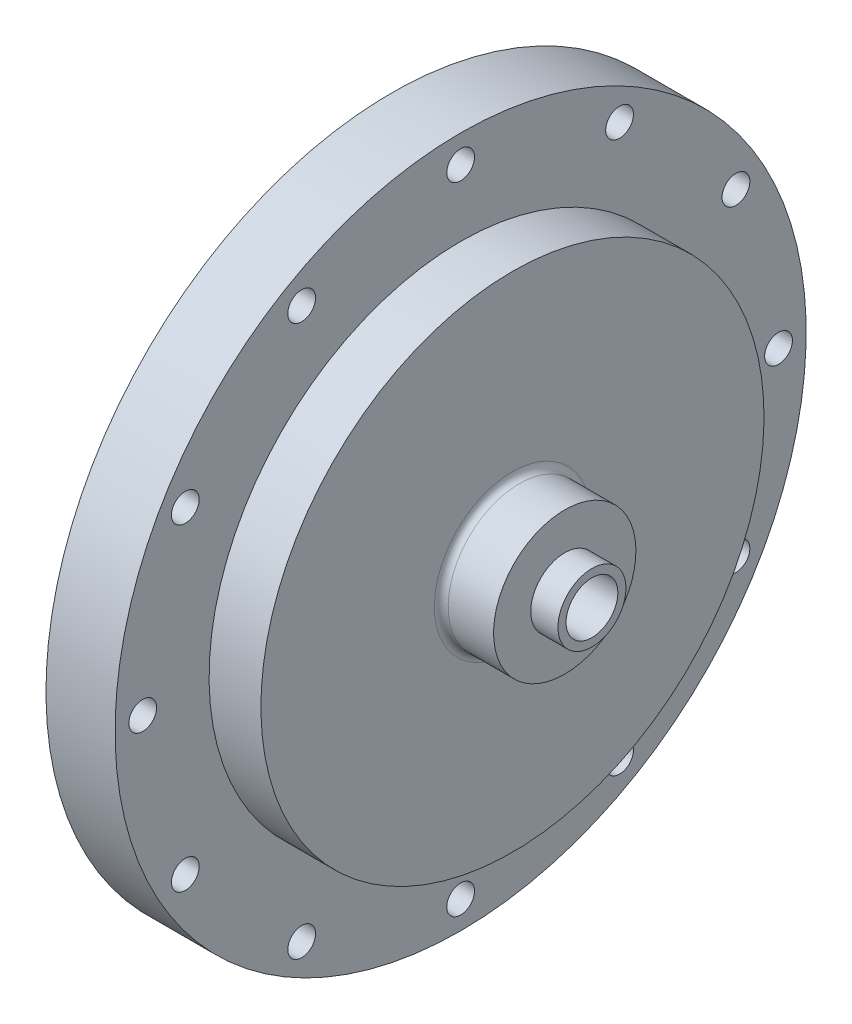
ISO-10303-21;
HEADER;
FILE_DESCRIPTION(('STEP AP214'),'2;1');
FILE_NAME('part.step','',(''),(''),'','','');
FILE_SCHEMA(('AUTOMOTIVE_DESIGN { 1 0 10303 214 1 1 1 1 }'));
ENDSEC;
DATA;
#1=APPLICATION_CONTEXT('core data for automotive mechanical design processes');
#2=APPLICATION_PROTOCOL_DEFINITION('international standard','automotive_design',2000,#1);
#3=PRODUCT_CONTEXT('',#1,'mechanical');
#4=PRODUCT('Part','Part','',(#3));
#5=PRODUCT_RELATED_PRODUCT_CATEGORY('part','',(#4));
#6=PRODUCT_DEFINITION_FORMATION('','',#4);
#7=PRODUCT_DEFINITION_CONTEXT('part definition',#1,'design');
#8=PRODUCT_DEFINITION('design','',#6,#7);
#9=PRODUCT_DEFINITION_SHAPE('','',#8);
#10=(LENGTH_UNIT() NAMED_UNIT(*) SI_UNIT(.MILLI.,.METRE.));
#11=(NAMED_UNIT(*) PLANE_ANGLE_UNIT() SI_UNIT($,.RADIAN.));
#12=(NAMED_UNIT(*) SI_UNIT($,.STERADIAN.) SOLID_ANGLE_UNIT());
#13=UNCERTAINTY_MEASURE_WITH_UNIT(LENGTH_MEASURE(1.E-05),#10,'distance_accuracy_value','');
#14=(GEOMETRIC_REPRESENTATION_CONTEXT(3) GLOBAL_UNCERTAINTY_ASSIGNED_CONTEXT((#13)) GLOBAL_UNIT_ASSIGNED_CONTEXT((#10,
#11,#12)) REPRESENTATION_CONTEXT('',''));
#15=CARTESIAN_POINT('',(0.,0.,0.));
#16=DIRECTION('',(0.,0.,1.));
#17=DIRECTION('',(1.,0.,0.));
#18=AXIS2_PLACEMENT_3D('',#15,#16,#17);
#19=CARTESIAN_POINT('',(31.75,63.5,0.));
#20=DIRECTION('',(-1.,0.,0.));
#21=DIRECTION('',(0.,-1.,0.));
#22=AXIS2_PLACEMENT_3D('',#19,#20,#21);
#23=PLANE('',#22);
#24=CARTESIAN_POINT('',(31.75,0.,0.));
#25=DIRECTION('',(-1.,0.,0.));
#26=DIRECTION('',(0.,-1.,0.));
#27=AXIS2_PLACEMENT_3D('',#24,#25,#26);
#28=CIRCLE('',#27,14.351);
#29=CARTESIAN_POINT('',(31.75,-14.351,0.));
#30=VERTEX_POINT('',#29);
#31=EDGE_CURVE('E190',#30,#30,#28,.T.);
#32=ORIENTED_EDGE('',*,*,#31,.T.);
#33=EDGE_LOOP('',(#32));
#34=FACE_BOUND('',#33,.T.);
#35=CARTESIAN_POINT('',(31.75,0.,0.));
#36=DIRECTION('',(1.,0.,0.));
#37=DIRECTION('',(0.,1.,0.));
#38=AXIS2_PLACEMENT_3D('',#35,#36,#37);
#39=CIRCLE('',#38,46.228);
#40=CARTESIAN_POINT('',(31.75,46.228,0.));
#41=VERTEX_POINT('',#40);
#42=EDGE_CURVE('E211',#41,#41,#39,.T.);
#43=ORIENTED_EDGE('',*,*,#42,.T.);
#44=EDGE_LOOP('',(#43));
#45=FACE_BOUND('',#44,.T.);
#46=ADVANCED_FACE('F45',(#34,#45),#23,.F.);
#47=CARTESIAN_POINT('',(9.525,0.,0.));
#48=DIRECTION('',(-1.,0.,0.));
#49=DIRECTION('',(0.,-1.,0.));
#50=AXIS2_PLACEMENT_3D('',#47,#48,#49);
#51=CYLINDRICAL_SURFACE('',#50,63.5);
#52=CARTESIAN_POINT('',(9.525,0.,0.));
#53=DIRECTION('',(-1.,0.,0.));
#54=DIRECTION('',(0.,-1.,0.));
#55=AXIS2_PLACEMENT_3D('',#52,#53,#54);
#56=CIRCLE('',#55,63.5);
#57=CARTESIAN_POINT('',(9.525,-63.5,0.));
#58=VERTEX_POINT('',#57);
#59=EDGE_CURVE('E363',#58,#58,#56,.T.);
#60=ORIENTED_EDGE('',*,*,#59,.F.);
#61=EDGE_LOOP('',(#60));
#62=FACE_BOUND('',#61,.T.);
#63=CARTESIAN_POINT('',(22.225,0.,0.));
#64=DIRECTION('',(1.,0.,0.));
#65=DIRECTION('',(0.,1.,0.));
#66=AXIS2_PLACEMENT_3D('',#63,#64,#65);
#67=CIRCLE('',#66,63.5);
#68=CARTESIAN_POINT('',(22.225,63.5,0.));
#69=VERTEX_POINT('',#68);
#70=EDGE_CURVE('E103',#69,#69,#67,.T.);
#71=ORIENTED_EDGE('',*,*,#70,.F.);
#72=EDGE_LOOP('',(#71));
#73=FACE_BOUND('',#72,.T.);
#74=ADVANCED_FACE('F207',(#62,#73),#51,.T.);
#75=CARTESIAN_POINT('',(31.75,-50.5932040890869,29.21));
#76=DIRECTION('',(1.,0.,0.));
#77=DIRECTION('',(0.,0.,-1.));
#78=AXIS2_PLACEMENT_3D('',#75,#76,#77);
#79=CYLINDRICAL_SURFACE('',#78,2.5527);
#80=CARTESIAN_POINT('',(9.525,-50.5932040890869,29.21));
#81=DIRECTION('',(1.,0.,0.));
#82=DIRECTION('',(0.,1.,0.));
#83=AXIS2_PLACEMENT_3D('',#80,#81,#82);
#84=CIRCLE('',#83,2.5527);
#85=CARTESIAN_POINT('',(9.525,-48.0405040890869,29.21));
#86=VERTEX_POINT('',#85);
#87=EDGE_CURVE('E357',#86,#86,#84,.T.);
#88=ORIENTED_EDGE('',*,*,#87,.F.);
#89=EDGE_LOOP('',(#88));
#90=FACE_BOUND('',#89,.T.);
#91=CARTESIAN_POINT('',(22.225,-50.5932040890869,29.21));
#92=DIRECTION('',(1.,0.,0.));
#93=DIRECTION('',(0.,1.,0.));
#94=AXIS2_PLACEMENT_3D('',#91,#92,#93);
#95=CIRCLE('',#94,2.5527);
#96=CARTESIAN_POINT('',(22.225,-48.0405040890869,29.21));
#97=VERTEX_POINT('',#96);
#98=EDGE_CURVE('E248',#97,#97,#95,.F.);
#99=ORIENTED_EDGE('',*,*,#98,.F.);
#100=EDGE_LOOP('',(#99));
#101=FACE_BOUND('',#100,.T.);
#102=ADVANCED_FACE('F255',(#90,#101),#79,.F.);
#103=CARTESIAN_POINT('',(31.75,-29.21,50.5932040890869));
#104=DIRECTION('',(1.,0.,0.));
#105=DIRECTION('',(0.,0.,-1.));
#106=AXIS2_PLACEMENT_3D('',#103,#104,#105);
#107=CYLINDRICAL_SURFACE('',#106,2.5527);
#108=CARTESIAN_POINT('',(9.525,-29.21,50.5932040890869));
#109=DIRECTION('',(1.,0.,0.));
#110=DIRECTION('',(0.,1.,0.));
#111=AXIS2_PLACEMENT_3D('',#108,#109,#110);
#112=CIRCLE('',#111,2.5527);
#113=CARTESIAN_POINT('',(9.525,-26.6573,50.5932040890869));
#114=VERTEX_POINT('',#113);
#115=EDGE_CURVE('E354',#114,#114,#112,.T.);
#116=ORIENTED_EDGE('',*,*,#115,.F.);
#117=EDGE_LOOP('',(#116));
#118=FACE_BOUND('',#117,.T.);
#119=CARTESIAN_POINT('',(22.225,-29.21,50.5932040890869));
#120=DIRECTION('',(1.,0.,0.));
#121=DIRECTION('',(0.,1.,0.));
#122=AXIS2_PLACEMENT_3D('',#119,#120,#121);
#123=CIRCLE('',#122,2.5527);
#124=CARTESIAN_POINT('',(22.225,-26.6573,50.5932040890869));
#125=VERTEX_POINT('',#124);
#126=EDGE_CURVE('E245',#125,#125,#123,.F.);
#127=ORIENTED_EDGE('',*,*,#126,.F.);
#128=EDGE_LOOP('',(#127));
#129=FACE_BOUND('',#128,.T.);
#130=ADVANCED_FACE('F260',(#118,#129),#107,.F.);
#131=CARTESIAN_POINT('',(31.75,0.,58.42));
#132=DIRECTION('',(1.,0.,0.));
#133=DIRECTION('',(0.,0.,-1.));
#134=AXIS2_PLACEMENT_3D('',#131,#132,#133);
#135=CYLINDRICAL_SURFACE('',#134,2.5527);
#136=CARTESIAN_POINT('',(9.525,0.,58.42));
#137=DIRECTION('',(1.,0.,0.));
#138=DIRECTION('',(0.,1.,0.));
#139=AXIS2_PLACEMENT_3D('',#136,#137,#138);
#140=CIRCLE('',#139,2.5527);
#141=CARTESIAN_POINT('',(9.525,2.5527,58.42));
#142=VERTEX_POINT('',#141);
#143=EDGE_CURVE('E351',#142,#142,#140,.T.);
#144=ORIENTED_EDGE('',*,*,#143,.F.);
#145=EDGE_LOOP('',(#144));
#146=FACE_BOUND('',#145,.T.);
#147=CARTESIAN_POINT('',(22.225,0.,58.42));
#148=DIRECTION('',(1.,0.,0.));
#149=DIRECTION('',(0.,1.,0.));
#150=AXIS2_PLACEMENT_3D('',#147,#148,#149);
#151=CIRCLE('',#150,2.5527);
#152=CARTESIAN_POINT('',(22.225,2.5527,58.42));
#153=VERTEX_POINT('',#152);
#154=EDGE_CURVE('E242',#153,#153,#151,.F.);
#155=ORIENTED_EDGE('',*,*,#154,.F.);
#156=EDGE_LOOP('',(#155));
#157=FACE_BOUND('',#156,.T.);
#158=ADVANCED_FACE('F626',(#146,#157),#135,.F.);
#159=CARTESIAN_POINT('',(31.75,29.21,50.5932040890869));
#160=DIRECTION('',(1.,0.,0.));
#161=DIRECTION('',(0.,0.,-1.));
#162=AXIS2_PLACEMENT_3D('',#159,#160,#161);
#163=CYLINDRICAL_SURFACE('',#162,2.5527);
#164=CARTESIAN_POINT('',(9.525,29.21,50.5932040890869));
#165=DIRECTION('',(1.,0.,0.));
#166=DIRECTION('',(0.,1.,0.));
#167=AXIS2_PLACEMENT_3D('',#164,#165,#166);
#168=CIRCLE('',#167,2.5527);
#169=CARTESIAN_POINT('',(9.525,31.7627,50.5932040890869));
#170=VERTEX_POINT('',#169);
#171=EDGE_CURVE('E348',#170,#170,#168,.T.);
#172=ORIENTED_EDGE('',*,*,#171,.F.);
#173=EDGE_LOOP('',(#172));
#174=FACE_BOUND('',#173,.T.);
#175=CARTESIAN_POINT('',(22.225,29.21,50.5932040890869));
#176=DIRECTION('',(1.,0.,0.));
#177=DIRECTION('',(0.,1.,0.));
#178=AXIS2_PLACEMENT_3D('',#175,#176,#177);
#179=CIRCLE('',#178,2.5527);
#180=CARTESIAN_POINT('',(22.225,31.7627,50.5932040890869));
#181=VERTEX_POINT('',#180);
#182=EDGE_CURVE('E239',#181,#181,#179,.F.);
#183=ORIENTED_EDGE('',*,*,#182,.F.);
#184=EDGE_LOOP('',(#183));
#185=FACE_BOUND('',#184,.T.);
#186=ADVANCED_FACE('F618',(#174,#185),#163,.F.);
#187=CARTESIAN_POINT('',(31.75,50.5932040890869,29.21));
#188=DIRECTION('',(1.,0.,0.));
#189=DIRECTION('',(0.,0.,-1.));
#190=AXIS2_PLACEMENT_3D('',#187,#188,#189);
#191=CYLINDRICAL_SURFACE('',#190,2.5527);
#192=CARTESIAN_POINT('',(9.525,50.5932040890869,29.21));
#193=DIRECTION('',(1.,0.,0.));
#194=DIRECTION('',(0.,1.,0.));
#195=AXIS2_PLACEMENT_3D('',#192,#193,#194);
#196=CIRCLE('',#195,2.5527);
#197=CARTESIAN_POINT('',(9.525,53.1459040890869,29.21));
#198=VERTEX_POINT('',#197);
#199=EDGE_CURVE('E345',#198,#198,#196,.T.);
#200=ORIENTED_EDGE('',*,*,#199,.F.);
#201=EDGE_LOOP('',(#200));
#202=FACE_BOUND('',#201,.T.);
#203=CARTESIAN_POINT('',(22.225,50.5932040890869,29.21));
#204=DIRECTION('',(1.,0.,0.));
#205=DIRECTION('',(0.,1.,0.));
#206=AXIS2_PLACEMENT_3D('',#203,#204,#205);
#207=CIRCLE('',#206,2.5527);
#208=CARTESIAN_POINT('',(22.225,53.1459040890869,29.21));
#209=VERTEX_POINT('',#208);
#210=EDGE_CURVE('E236',#209,#209,#207,.F.);
#211=ORIENTED_EDGE('',*,*,#210,.F.);
#212=EDGE_LOOP('',(#211));
#213=FACE_BOUND('',#212,.T.);
#214=ADVANCED_FACE('F610',(#202,#213),#191,.F.);
#215=CARTESIAN_POINT('',(31.75,58.42,0.));
#216=DIRECTION('',(1.,0.,0.));
#217=DIRECTION('',(0.,0.,-1.));
#218=AXIS2_PLACEMENT_3D('',#215,#216,#217);
#219=CYLINDRICAL_SURFACE('',#218,2.5527);
#220=CARTESIAN_POINT('',(9.525,58.42,0.));
#221=DIRECTION('',(1.,0.,0.));
#222=DIRECTION('',(0.,1.,0.));
#223=AXIS2_PLACEMENT_3D('',#220,#221,#222);
#224=CIRCLE('',#223,2.5527);
#225=CARTESIAN_POINT('',(9.525,60.9727,0.));
#226=VERTEX_POINT('',#225);
#227=EDGE_CURVE('E342',#226,#226,#224,.T.);
#228=ORIENTED_EDGE('',*,*,#227,.F.);
#229=EDGE_LOOP('',(#228));
#230=FACE_BOUND('',#229,.T.);
#231=CARTESIAN_POINT('',(22.225,58.42,0.));
#232=DIRECTION('',(1.,0.,0.));
#233=DIRECTION('',(0.,1.,0.));
#234=AXIS2_PLACEMENT_3D('',#231,#232,#233);
#235=CIRCLE('',#234,2.5527);
#236=CARTESIAN_POINT('',(22.225,60.9727,0.));
#237=VERTEX_POINT('',#236);
#238=EDGE_CURVE('E233',#237,#237,#235,.F.);
#239=ORIENTED_EDGE('',*,*,#238,.F.);
#240=EDGE_LOOP('',(#239));
#241=FACE_BOUND('',#240,.T.);
#242=ADVANCED_FACE('F602',(#230,#241),#219,.F.);
#243=CARTESIAN_POINT('',(31.75,50.5932040890869,-29.21));
#244=DIRECTION('',(1.,0.,0.));
#245=DIRECTION('',(0.,0.,-1.));
#246=AXIS2_PLACEMENT_3D('',#243,#244,#245);
#247=CYLINDRICAL_SURFACE('',#246,2.5527);
#248=CARTESIAN_POINT('',(9.525,50.5932040890869,-29.21));
#249=DIRECTION('',(1.,0.,0.));
#250=DIRECTION('',(0.,1.,0.));
#251=AXIS2_PLACEMENT_3D('',#248,#249,#250);
#252=CIRCLE('',#251,2.5527);
#253=CARTESIAN_POINT('',(9.525,53.1459040890869,-29.21));
#254=VERTEX_POINT('',#253);
#255=EDGE_CURVE('E339',#254,#254,#252,.T.);
#256=ORIENTED_EDGE('',*,*,#255,.F.);
#257=EDGE_LOOP('',(#256));
#258=FACE_BOUND('',#257,.T.);
#259=CARTESIAN_POINT('',(22.225,50.5932040890869,-29.21));
#260=DIRECTION('',(1.,0.,0.));
#261=DIRECTION('',(0.,1.,0.));
#262=AXIS2_PLACEMENT_3D('',#259,#260,#261);
#263=CIRCLE('',#262,2.5527);
#264=CARTESIAN_POINT('',(22.225,53.1459040890869,-29.21));
#265=VERTEX_POINT('',#264);
#266=EDGE_CURVE('E230',#265,#265,#263,.F.);
#267=ORIENTED_EDGE('',*,*,#266,.F.);
#268=EDGE_LOOP('',(#267));
#269=FACE_BOUND('',#268,.T.);
#270=ADVANCED_FACE('F594',(#258,#269),#247,.F.);
#271=CARTESIAN_POINT('',(31.75,29.21,-50.5932040890869));
#272=DIRECTION('',(1.,0.,0.));
#273=DIRECTION('',(0.,0.,-1.));
#274=AXIS2_PLACEMENT_3D('',#271,#272,#273);
#275=CYLINDRICAL_SURFACE('',#274,2.55269999999999);
#276=CARTESIAN_POINT('',(9.525,29.21,-50.5932040890869));
#277=DIRECTION('',(1.,0.,0.));
#278=DIRECTION('',(0.,1.,0.));
#279=AXIS2_PLACEMENT_3D('',#276,#277,#278);
#280=CIRCLE('',#279,2.55269999999999);
#281=CARTESIAN_POINT('',(9.525,31.7627,-50.5932040890869));
#282=VERTEX_POINT('',#281);
#283=EDGE_CURVE('E336',#282,#282,#280,.T.);
#284=ORIENTED_EDGE('',*,*,#283,.F.);
#285=EDGE_LOOP('',(#284));
#286=FACE_BOUND('',#285,.T.);
#287=CARTESIAN_POINT('',(22.225,29.21,-50.5932040890869));
#288=DIRECTION('',(1.,0.,0.));
#289=DIRECTION('',(0.,1.,0.));
#290=AXIS2_PLACEMENT_3D('',#287,#288,#289);
#291=CIRCLE('',#290,2.55269999999999);
#292=CARTESIAN_POINT('',(22.225,31.7627,-50.5932040890869));
#293=VERTEX_POINT('',#292);
#294=EDGE_CURVE('E227',#293,#293,#291,.F.);
#295=ORIENTED_EDGE('',*,*,#294,.F.);
#296=EDGE_LOOP('',(#295));
#297=FACE_BOUND('',#296,.T.);
#298=ADVANCED_FACE('F586',(#286,#297),#275,.F.);
#299=CARTESIAN_POINT('',(31.75,0.,-58.42));
#300=DIRECTION('',(1.,0.,0.));
#301=DIRECTION('',(0.,0.,-1.));
#302=AXIS2_PLACEMENT_3D('',#299,#300,#301);
#303=CYLINDRICAL_SURFACE('',#302,2.5527);
#304=CARTESIAN_POINT('',(9.525,0.,-58.42));
#305=DIRECTION('',(1.,0.,0.));
#306=DIRECTION('',(0.,1.,0.));
#307=AXIS2_PLACEMENT_3D('',#304,#305,#306);
#308=CIRCLE('',#307,2.5527);
#309=CARTESIAN_POINT('',(9.525,2.5527,-58.42));
#310=VERTEX_POINT('',#309);
#311=EDGE_CURVE('E333',#310,#310,#308,.T.);
#312=ORIENTED_EDGE('',*,*,#311,.F.);
#313=EDGE_LOOP('',(#312));
#314=FACE_BOUND('',#313,.T.);
#315=CARTESIAN_POINT('',(22.225,0.,-58.42));
#316=DIRECTION('',(1.,0.,0.));
#317=DIRECTION('',(0.,1.,0.));
#318=AXIS2_PLACEMENT_3D('',#315,#316,#317);
#319=CIRCLE('',#318,2.5527);
#320=CARTESIAN_POINT('',(22.225,2.5527,-58.42));
#321=VERTEX_POINT('',#320);
#322=EDGE_CURVE('E224',#321,#321,#319,.F.);
#323=ORIENTED_EDGE('',*,*,#322,.F.);
#324=EDGE_LOOP('',(#323));
#325=FACE_BOUND('',#324,.T.);
#326=ADVANCED_FACE('F578',(#314,#325),#303,.F.);
#327=CARTESIAN_POINT('',(31.75,-29.21,-50.5932040890869));
#328=DIRECTION('',(1.,0.,0.));
#329=DIRECTION('',(0.,0.,-1.));
#330=AXIS2_PLACEMENT_3D('',#327,#328,#329);
#331=CYLINDRICAL_SURFACE('',#330,2.5527);
#332=CARTESIAN_POINT('',(9.525,-29.21,-50.5932040890869));
#333=DIRECTION('',(1.,0.,0.));
#334=DIRECTION('',(0.,1.,0.));
#335=AXIS2_PLACEMENT_3D('',#332,#333,#334);
#336=CIRCLE('',#335,2.5527);
#337=CARTESIAN_POINT('',(9.525,-26.6573,-50.5932040890869));
#338=VERTEX_POINT('',#337);
#339=EDGE_CURVE('E330',#338,#338,#336,.T.);
#340=ORIENTED_EDGE('',*,*,#339,.F.);
#341=EDGE_LOOP('',(#340));
#342=FACE_BOUND('',#341,.T.);
#343=CARTESIAN_POINT('',(22.225,-29.21,-50.5932040890869));
#344=DIRECTION('',(1.,0.,0.));
#345=DIRECTION('',(0.,1.,0.));
#346=AXIS2_PLACEMENT_3D('',#343,#344,#345);
#347=CIRCLE('',#346,2.5527);
#348=CARTESIAN_POINT('',(22.225,-26.6573,-50.5932040890869));
#349=VERTEX_POINT('',#348);
#350=EDGE_CURVE('E221',#349,#349,#347,.F.);
#351=ORIENTED_EDGE('',*,*,#350,.F.);
#352=EDGE_LOOP('',(#351));
#353=FACE_BOUND('',#352,.T.);
#354=ADVANCED_FACE('F570',(#342,#353),#331,.F.);
#355=CARTESIAN_POINT('',(31.75,-50.5932040890869,-29.21));
#356=DIRECTION('',(1.,0.,0.));
#357=DIRECTION('',(0.,0.,-1.));
#358=AXIS2_PLACEMENT_3D('',#355,#356,#357);
#359=CYLINDRICAL_SURFACE('',#358,2.5527);
#360=CARTESIAN_POINT('',(9.525,-50.5932040890869,-29.21));
#361=DIRECTION('',(1.,0.,0.));
#362=DIRECTION('',(0.,1.,0.));
#363=AXIS2_PLACEMENT_3D('',#360,#361,#362);
#364=CIRCLE('',#363,2.5527);
#365=CARTESIAN_POINT('',(9.525,-48.0405040890869,-29.21));
#366=VERTEX_POINT('',#365);
#367=EDGE_CURVE('E327',#366,#366,#364,.T.);
#368=ORIENTED_EDGE('',*,*,#367,.F.);
#369=EDGE_LOOP('',(#368));
#370=FACE_BOUND('',#369,.T.);
#371=CARTESIAN_POINT('',(22.225,-50.5932040890869,-29.21));
#372=DIRECTION('',(1.,0.,0.));
#373=DIRECTION('',(0.,1.,0.));
#374=AXIS2_PLACEMENT_3D('',#371,#372,#373);
#375=CIRCLE('',#374,2.5527);
#376=CARTESIAN_POINT('',(22.225,-48.0405040890869,-29.21));
#377=VERTEX_POINT('',#376);
#378=EDGE_CURVE('E218',#377,#377,#375,.F.);
#379=ORIENTED_EDGE('',*,*,#378,.F.);
#380=EDGE_LOOP('',(#379));
#381=FACE_BOUND('',#380,.T.);
#382=ADVANCED_FACE('F561',(#370,#381),#359,.F.);
#383=CARTESIAN_POINT('',(31.75,-58.42,0.));
#384=DIRECTION('',(1.,0.,0.));
#385=DIRECTION('',(0.,0.,-1.));
#386=AXIS2_PLACEMENT_3D('',#383,#384,#385);
#387=CYLINDRICAL_SURFACE('',#386,2.5527);
#388=CARTESIAN_POINT('',(9.525,-58.42,0.));
#389=DIRECTION('',(1.,0.,0.));
#390=DIRECTION('',(0.,1.,0.));
#391=AXIS2_PLACEMENT_3D('',#388,#389,#390);
#392=CIRCLE('',#391,2.5527);
#393=CARTESIAN_POINT('',(9.525,-55.8673,0.));
#394=VERTEX_POINT('',#393);
#395=EDGE_CURVE('E324',#394,#394,#392,.T.);
#396=ORIENTED_EDGE('',*,*,#395,.F.);
#397=EDGE_LOOP('',(#396));
#398=FACE_BOUND('',#397,.T.);
#399=CARTESIAN_POINT('',(22.225,-58.42,0.));
#400=DIRECTION('',(1.,0.,0.));
#401=DIRECTION('',(0.,1.,0.));
#402=AXIS2_PLACEMENT_3D('',#399,#400,#401);
#403=CIRCLE('',#402,2.5527);
#404=CARTESIAN_POINT('',(22.225,-55.8673,0.));
#405=VERTEX_POINT('',#404);
#406=EDGE_CURVE('E49',#405,#405,#403,.F.);
#407=ORIENTED_EDGE('',*,*,#406,.F.);
#408=EDGE_LOOP('',(#407));
#409=FACE_BOUND('',#408,.T.);
#410=ADVANCED_FACE('F381',(#398,#409),#387,.F.);
#411=CARTESIAN_POINT('',(9.525,0.,0.));
#412=DIRECTION('',(1.,0.,0.));
#413=DIRECTION('',(0.,1.,0.));
#414=AXIS2_PLACEMENT_3D('',#411,#412,#413);
#415=PLANE('',#414);
#416=ORIENTED_EDGE('',*,*,#59,.T.);
#417=EDGE_LOOP('',(#416));
#418=FACE_BOUND('',#417,.T.);
#419=ORIENTED_EDGE('',*,*,#87,.T.);
#420=EDGE_LOOP('',(#419));
#421=FACE_BOUND('',#420,.T.);
#422=ORIENTED_EDGE('',*,*,#115,.T.);
#423=EDGE_LOOP('',(#422));
#424=FACE_BOUND('',#423,.T.);
#425=ORIENTED_EDGE('',*,*,#143,.T.);
#426=EDGE_LOOP('',(#425));
#427=FACE_BOUND('',#426,.T.);
#428=ORIENTED_EDGE('',*,*,#171,.T.);
#429=EDGE_LOOP('',(#428));
#430=FACE_BOUND('',#429,.T.);
#431=ORIENTED_EDGE('',*,*,#199,.T.);
#432=EDGE_LOOP('',(#431));
#433=FACE_BOUND('',#432,.T.);
#434=ORIENTED_EDGE('',*,*,#227,.T.);
#435=EDGE_LOOP('',(#434));
#436=FACE_BOUND('',#435,.T.);
#437=ORIENTED_EDGE('',*,*,#255,.T.);
#438=EDGE_LOOP('',(#437));
#439=FACE_BOUND('',#438,.T.);
#440=ORIENTED_EDGE('',*,*,#283,.T.);
#441=EDGE_LOOP('',(#440));
#442=FACE_BOUND('',#441,.T.);
#443=ORIENTED_EDGE('',*,*,#311,.T.);
#444=EDGE_LOOP('',(#443));
#445=FACE_BOUND('',#444,.T.);
#446=ORIENTED_EDGE('',*,*,#339,.T.);
#447=EDGE_LOOP('',(#446));
#448=FACE_BOUND('',#447,.T.);
#449=ORIENTED_EDGE('',*,*,#367,.T.);
#450=EDGE_LOOP('',(#449));
#451=FACE_BOUND('',#450,.T.);
#452=ORIENTED_EDGE('',*,*,#395,.T.);
#453=EDGE_LOOP('',(#452));
#454=FACE_BOUND('',#453,.T.);
#455=CARTESIAN_POINT('',(9.525,15.120208614887,-56.429386771808));
#456=DIRECTION('',(-1.,0.,0.));
#457=DIRECTION('',(0.,0.,1.));
#458=AXIS2_PLACEMENT_3D('',#455,#456,#457);
#459=CIRCLE('',#458,2.38125);
#460=CARTESIAN_POINT('',(9.525,15.120208614887,-54.048136771808));
#461=VERTEX_POINT('',#460);
#462=EDGE_CURVE('E318',#461,#461,#459,.T.);
#463=ORIENTED_EDGE('',*,*,#462,.F.);
#464=EDGE_LOOP('',(#463));
#465=FACE_BOUND('',#464,.T.);
#466=CARTESIAN_POINT('',(9.525,-15.1202086148874,56.4293867718079));
#467=DIRECTION('',(-1.,0.,0.));
#468=DIRECTION('',(0.,0.,1.));
#469=AXIS2_PLACEMENT_3D('',#466,#467,#468);
#470=CIRCLE('',#469,2.38125);
#471=CARTESIAN_POINT('',(9.525,-15.1202086148874,58.8106367718079));
#472=VERTEX_POINT('',#471);
#473=EDGE_CURVE('E309',#472,#472,#470,.T.);
#474=ORIENTED_EDGE('',*,*,#473,.F.);
#475=EDGE_LOOP('',(#474));
#476=FACE_BOUND('',#475,.T.);
#477=CARTESIAN_POINT('',(9.525,0.,0.));
#478=DIRECTION('',(1.,0.,0.));
#479=DIRECTION('',(0.,1.,0.));
#480=AXIS2_PLACEMENT_3D('',#477,#478,#479);
#481=CIRCLE('',#480,44.45);
#482=CARTESIAN_POINT('',(9.525,44.45,0.));
#483=VERTEX_POINT('',#482);
#484=EDGE_CURVE('E13',#483,#483,#481,.F.);
#485=ORIENTED_EDGE('',*,*,#484,.F.);
#486=EDGE_LOOP('',(#485));
#487=FACE_BOUND('',#486,.T.);
#488=ADVANCED_FACE('F284',(#418,#421,#424,#427,#430,#433,#436,#439,#442,#445,#448,#451,#454,
#465,#476,#487),#415,.F.);
#489=ORIENTED_EDGE('',*,*,#484,.T.);
#490=EDGE_LOOP('',(#489));
#491=FACE_BOUND('',#490,.T.);
#492=CARTESIAN_POINT('',(9.525,23.5731723178062,23.5731723178068));
#493=DIRECTION('',(-1.,0.,0.));
#494=DIRECTION('',(0.,0.,1.));
#495=AXIS2_PLACEMENT_3D('',#492,#493,#494);
#496=CIRCLE('',#495,1.13029999999999);
#497=CARTESIAN_POINT('',(9.525,23.5731723178062,24.7034723178068));
#498=VERTEX_POINT('',#497);
#499=EDGE_CURVE('E97',#498,#498,#496,.T.);
#500=ORIENTED_EDGE('',*,*,#499,.F.);
#501=EDGE_LOOP('',(#500));
#502=FACE_BOUND('',#501,.T.);
#503=CARTESIAN_POINT('',(9.525,33.3375,3.49191777401049E-13));
#504=DIRECTION('',(-1.,0.,0.));
#505=DIRECTION('',(0.,0.,1.));
#506=AXIS2_PLACEMENT_3D('',#503,#504,#505);
#507=CIRCLE('',#506,1.13029999999999);
#508=CARTESIAN_POINT('',(9.525,33.3375,1.13030000000034));
#509=VERTEX_POINT('',#508);
#510=EDGE_CURVE('E96',#509,#509,#507,.T.);
#511=ORIENTED_EDGE('',*,*,#510,.F.);
#512=EDGE_LOOP('',(#511));
#513=FACE_BOUND('',#512,.T.);
#514=CARTESIAN_POINT('',(9.525,0.,-33.3375));
#515=DIRECTION('',(-1.,0.,0.));
#516=DIRECTION('',(0.,0.,1.));
#517=AXIS2_PLACEMENT_3D('',#514,#515,#516);
#518=CIRCLE('',#517,1.13029999999999);
#519=CARTESIAN_POINT('',(9.525,0.,-32.2072));
#520=VERTEX_POINT('',#519);
#521=EDGE_CURVE('E115',#520,#520,#518,.T.);
#522=ORIENTED_EDGE('',*,*,#521,.F.);
#523=EDGE_LOOP('',(#522));
#524=FACE_BOUND('',#523,.T.);
#525=CARTESIAN_POINT('',(9.525,-23.5731723178064,-23.5731723178067));
#526=DIRECTION('',(-1.,0.,0.));
#527=DIRECTION('',(0.,0.,1.));
#528=AXIS2_PLACEMENT_3D('',#525,#526,#527);
#529=CIRCLE('',#528,1.13029999999999);
#530=CARTESIAN_POINT('',(9.525,-23.5731723178064,-22.4428723178067));
#531=VERTEX_POINT('',#530);
#532=EDGE_CURVE('E121',#531,#531,#529,.T.);
#533=ORIENTED_EDGE('',*,*,#532,.F.);
#534=EDGE_LOOP('',(#533));
#535=FACE_BOUND('',#534,.T.);
#536=CARTESIAN_POINT('',(9.525,-33.3375,-1.16397259133683E-13));
#537=DIRECTION('',(-1.,0.,0.));
#538=DIRECTION('',(0.,0.,1.));
#539=AXIS2_PLACEMENT_3D('',#536,#537,#538);
#540=CIRCLE('',#539,1.13029999999999);
#541=CARTESIAN_POINT('',(9.525,-33.3375,1.13029999999987));
#542=VERTEX_POINT('',#541);
#543=EDGE_CURVE('E127',#542,#542,#540,.T.);
#544=ORIENTED_EDGE('',*,*,#543,.F.);
#545=EDGE_LOOP('',(#544));
#546=FACE_BOUND('',#545,.T.);
#547=CARTESIAN_POINT('',(9.525,-23.5731723178066,23.5731723178065));
#548=DIRECTION('',(-1.,0.,0.));
#549=DIRECTION('',(0.,0.,1.));
#550=AXIS2_PLACEMENT_3D('',#547,#548,#549);
#551=CIRCLE('',#550,1.13029999999999);
#552=CARTESIAN_POINT('',(9.525,-23.5731723178066,24.7034723178065));
#553=VERTEX_POINT('',#552);
#554=EDGE_CURVE('E133',#553,#553,#551,.T.);
#555=ORIENTED_EDGE('',*,*,#554,.F.);
#556=EDGE_LOOP('',(#555));
#557=FACE_BOUND('',#556,.T.);
#558=CARTESIAN_POINT('',(9.525,0.,33.3375));
#559=DIRECTION('',(-1.,0.,0.));
#560=DIRECTION('',(0.,0.,1.));
#561=AXIS2_PLACEMENT_3D('',#558,#559,#560);
#562=CIRCLE('',#561,1.13029999999999);
#563=CARTESIAN_POINT('',(9.525,0.,34.4678));
#564=VERTEX_POINT('',#563);
#565=EDGE_CURVE('E139',#564,#564,#562,.T.);
#566=ORIENTED_EDGE('',*,*,#565,.F.);
#567=EDGE_LOOP('',(#566));
#568=FACE_BOUND('',#567,.T.);
#569=CARTESIAN_POINT('',(9.525,0.,0.));
#570=DIRECTION('',(-1.,0.,0.));
#571=DIRECTION('',(0.,-1.,0.));
#572=AXIS2_PLACEMENT_3D('',#569,#570,#571);
#573=CIRCLE('',#572,28.575);
#574=CARTESIAN_POINT('',(9.525,-28.575,0.));
#575=VERTEX_POINT('',#574);
#576=EDGE_CURVE('E307',#575,#575,#573,.T.);
#577=ORIENTED_EDGE('',*,*,#576,.F.);
#578=EDGE_LOOP('',(#577));
#579=FACE_BOUND('',#578,.T.);
#580=CARTESIAN_POINT('',(9.525,23.5731723178067,-23.5731723178063));
#581=DIRECTION('',(-1.,0.,0.));
#582=DIRECTION('',(0.,0.,1.));
#583=AXIS2_PLACEMENT_3D('',#580,#581,#582);
#584=CIRCLE('',#583,1.13029999999999);
#585=CARTESIAN_POINT('',(9.525,23.5731723178067,-22.4428723178063));
#586=VERTEX_POINT('',#585);
#587=EDGE_CURVE('E109',#586,#586,#584,.T.);
#588=ORIENTED_EDGE('',*,*,#587,.F.);
#589=EDGE_LOOP('',(#588));
#590=FACE_BOUND('',#589,.T.);
#591=ADVANCED_FACE('F281',(#491,#502,#513,#524,#535,#546,#557,#568,#579,#590),#415,.F.);
#592=CARTESIAN_POINT('',(9.525,0.,0.));
#593=DIRECTION('',(1.,0.,0.));
#594=DIRECTION('',(0.,0.,-1.));
#595=AXIS2_PLACEMENT_3D('',#592,#593,#594);
#596=CYLINDRICAL_SURFACE('',#595,4.7625);
#597=CARTESIAN_POINT('',(30.48,0.,0.));
#598=DIRECTION('',(-1.,0.,0.));
#599=DIRECTION('',(0.,-1.,0.));
#600=AXIS2_PLACEMENT_3D('',#597,#598,#599);
#601=CIRCLE('',#600,4.7625);
#602=CARTESIAN_POINT('',(30.48,-4.7625,0.));
#603=VERTEX_POINT('',#602);
#604=EDGE_CURVE('E182',#603,#603,#601,.T.);
#605=ORIENTED_EDGE('',*,*,#604,.T.);
#606=EDGE_LOOP('',(#605));
#607=FACE_BOUND('',#606,.T.);
#608=CARTESIAN_POINT('',(46.355,0.,0.));
#609=DIRECTION('',(1.,0.,0.));
#610=DIRECTION('',(0.,0.,-1.));
#611=AXIS2_PLACEMENT_3D('',#608,#609,#610);
#612=CIRCLE('',#611,4.7625);
#613=CARTESIAN_POINT('',(46.355,0.,-4.7625));
#614=VERTEX_POINT('',#613);
#615=EDGE_CURVE('E360',#614,#614,#612,.T.);
#616=ORIENTED_EDGE('',*,*,#615,.T.);
#617=EDGE_LOOP('',(#616));
#618=FACE_BOUND('',#617,.T.);
#619=ADVANCED_FACE('F268',(#607,#618),#596,.F.);
#620=CARTESIAN_POINT('',(9.525,0.,0.));
#621=DIRECTION('',(-1.,0.,0.));
#622=DIRECTION('',(0.,-1.,0.));
#623=AXIS2_PLACEMENT_3D('',#620,#621,#622);
#624=CYLINDRICAL_SURFACE('',#623,13.081);
#625=CARTESIAN_POINT('',(33.02,0.,0.));
#626=DIRECTION('',(-1.,0.,0.));
#627=DIRECTION('',(0.,-1.,0.));
#628=AXIS2_PLACEMENT_3D('',#625,#626,#627);
#629=CIRCLE('',#628,13.081);
#630=CARTESIAN_POINT('',(33.02,-13.081,0.));
#631=VERTEX_POINT('',#630);
#632=EDGE_CURVE('E55',#631,#631,#629,.F.);
#633=ORIENTED_EDGE('',*,*,#632,.T.);
#634=EDGE_LOOP('',(#633));
#635=FACE_BOUND('',#634,.T.);
#636=CARTESIAN_POINT('',(41.355,0.,0.));
#637=DIRECTION('',(-1.,0.,0.));
#638=DIRECTION('',(0.,-1.,0.));
#639=AXIS2_PLACEMENT_3D('',#636,#637,#638);
#640=CIRCLE('',#639,13.081);
#641=CARTESIAN_POINT('',(41.355,-13.081,0.));
#642=VERTEX_POINT('',#641);
#643=EDGE_CURVE('E193',#642,#642,#640,.T.);
#644=ORIENTED_EDGE('',*,*,#643,.T.);
#645=EDGE_LOOP('',(#644));
#646=FACE_BOUND('',#645,.T.);
#647=ADVANCED_FACE('F197',(#635,#646),#624,.T.);
#648=CARTESIAN_POINT('',(41.355,13.081,0.));
#649=DIRECTION('',(-1.,0.,0.));
#650=DIRECTION('',(0.,-1.,0.));
#651=AXIS2_PLACEMENT_3D('',#648,#649,#650);
#652=PLANE('',#651);
#653=ORIENTED_EDGE('',*,*,#643,.F.);
#654=EDGE_LOOP('',(#653));
#655=FACE_BOUND('',#654,.T.);
#656=CARTESIAN_POINT('',(41.355,0.,0.));
#657=DIRECTION('',(-1.,0.,0.));
#658=DIRECTION('',(0.,-1.,0.));
#659=AXIS2_PLACEMENT_3D('',#656,#657,#658);
#660=CIRCLE('',#659,6.2484);
#661=CARTESIAN_POINT('',(41.355,-6.2484,0.));
#662=VERTEX_POINT('',#661);
#663=EDGE_CURVE('E369',#662,#662,#660,.T.);
#664=ORIENTED_EDGE('',*,*,#663,.T.);
#665=EDGE_LOOP('',(#664));
#666=FACE_BOUND('',#665,.T.);
#667=ADVANCED_FACE('F267',(#655,#666),#652,.F.);
#668=CARTESIAN_POINT('',(9.525,0.,0.));
#669=DIRECTION('',(-1.,0.,0.));
#670=DIRECTION('',(0.,-1.,0.));
#671=AXIS2_PLACEMENT_3D('',#668,#669,#670);
#672=CYLINDRICAL_SURFACE('',#671,6.2484);
#673=ORIENTED_EDGE('',*,*,#663,.F.);
#674=EDGE_LOOP('',(#673));
#675=FACE_BOUND('',#674,.T.);
#676=CARTESIAN_POINT('',(46.355,0.,0.));
#677=DIRECTION('',(-1.,0.,0.));
#678=DIRECTION('',(0.,-1.,0.));
#679=AXIS2_PLACEMENT_3D('',#676,#677,#678);
#680=CIRCLE('',#679,6.2484);
#681=CARTESIAN_POINT('',(46.355,-6.2484,0.));
#682=VERTEX_POINT('',#681);
#683=EDGE_CURVE('E366',#682,#682,#680,.T.);
#684=ORIENTED_EDGE('',*,*,#683,.T.);
#685=EDGE_LOOP('',(#684));
#686=FACE_BOUND('',#685,.T.);
#687=ADVANCED_FACE('F271',(#675,#686),#672,.T.);
#688=CARTESIAN_POINT('',(46.355,6.2484,0.));
#689=DIRECTION('',(-1.,0.,0.));
#690=DIRECTION('',(0.,-1.,0.));
#691=AXIS2_PLACEMENT_3D('',#688,#689,#690);
#692=PLANE('',#691);
#693=ORIENTED_EDGE('',*,*,#615,.F.);
#694=EDGE_LOOP('',(#693));
#695=FACE_BOUND('',#694,.T.);
#696=ORIENTED_EDGE('',*,*,#683,.F.);
#697=EDGE_LOOP('',(#696));
#698=FACE_BOUND('',#697,.T.);
#699=ADVANCED_FACE('F275',(#695,#698),#692,.F.);
#700=CARTESIAN_POINT('',(15.875,15.120208614887,-56.429386771808));
#701=DIRECTION('',(-1.,0.,0.));
#702=DIRECTION('',(0.,0.,1.));
#703=AXIS2_PLACEMENT_3D('',#700,#701,#702);
#704=CONICAL_SURFACE('',#703,2.38124999999999,1.02974425867665);
#705=CARTESIAN_POINT('',(17.3057993490594,15.120208614887,-56.429386771808));
#706=VERTEX_POINT('',#705);
#707=VERTEX_LOOP('',#706);
#708=FACE_BOUND('',#707,.T.);
#709=CARTESIAN_POINT('',(15.875,15.120208614887,-56.429386771808));
#710=DIRECTION('',(-1.,0.,0.));
#711=DIRECTION('',(0.,0.,1.));
#712=AXIS2_PLACEMENT_3D('',#709,#710,#711);
#713=CIRCLE('',#712,2.38124999999999);
#714=CARTESIAN_POINT('',(15.875,15.120208614887,-54.048136771808));
#715=VERTEX_POINT('',#714);
#716=EDGE_CURVE('E321',#715,#715,#713,.T.);
#717=ORIENTED_EDGE('',*,*,#716,.T.);
#718=EDGE_LOOP('',(#717));
#719=FACE_BOUND('',#718,.T.);
#720=ADVANCED_FACE('F279',(#708,#719),#704,.F.);
#721=CARTESIAN_POINT('',(9.525,15.120208614887,-56.429386771808));
#722=DIRECTION('',(-1.,0.,0.));
#723=DIRECTION('',(0.,0.,1.));
#724=AXIS2_PLACEMENT_3D('',#721,#722,#723);
#725=CYLINDRICAL_SURFACE('',#724,2.38125);
#726=ORIENTED_EDGE('',*,*,#716,.F.);
#727=EDGE_LOOP('',(#726));
#728=FACE_BOUND('',#727,.T.);
#729=ORIENTED_EDGE('',*,*,#462,.T.);
#730=EDGE_LOOP('',(#729));
#731=FACE_BOUND('',#730,.T.);
#732=ADVANCED_FACE('F511',(#728,#731),#725,.F.);
#733=CARTESIAN_POINT('',(15.875,-15.1202086148874,56.4293867718079));
#734=DIRECTION('',(-1.,0.,0.));
#735=DIRECTION('',(0.,0.,1.));
#736=AXIS2_PLACEMENT_3D('',#733,#734,#735);
#737=CONICAL_SURFACE('',#736,2.38125,1.02974425867665);
#738=CARTESIAN_POINT('',(17.3057993490594,-15.1202086148874,56.4293867718079));
#739=VERTEX_POINT('',#738);
#740=VERTEX_LOOP('',#739);
#741=FACE_BOUND('',#740,.T.);
#742=CARTESIAN_POINT('',(15.875,-15.1202086148874,56.4293867718079));
#743=DIRECTION('',(-1.,0.,0.));
#744=DIRECTION('',(0.,0.,1.));
#745=AXIS2_PLACEMENT_3D('',#742,#743,#744);
#746=CIRCLE('',#745,2.38125);
#747=CARTESIAN_POINT('',(15.875,-15.1202086148874,58.8106367718079));
#748=VERTEX_POINT('',#747);
#749=EDGE_CURVE('E312',#748,#748,#746,.T.);
#750=ORIENTED_EDGE('',*,*,#749,.T.);
#751=EDGE_LOOP('',(#750));
#752=FACE_BOUND('',#751,.T.);
#753=ADVANCED_FACE('F504',(#741,#752),#737,.F.);
#754=CARTESIAN_POINT('',(9.525,-15.1202086148874,56.4293867718079));
#755=DIRECTION('',(-1.,0.,0.));
#756=DIRECTION('',(0.,0.,1.));
#757=AXIS2_PLACEMENT_3D('',#754,#755,#756);
#758=CYLINDRICAL_SURFACE('',#757,2.38125);
#759=ORIENTED_EDGE('',*,*,#749,.F.);
#760=EDGE_LOOP('',(#759));
#761=FACE_BOUND('',#760,.T.);
#762=ORIENTED_EDGE('',*,*,#473,.T.);
#763=EDGE_LOOP('',(#762));
#764=FACE_BOUND('',#763,.T.);
#765=ADVANCED_FACE('F304',(#761,#764),#758,.F.);
#766=CARTESIAN_POINT('',(19.05,0.,0.));
#767=DIRECTION('',(-1.,0.,0.));
#768=DIRECTION('',(0.,-1.,0.));
#769=AXIS2_PLACEMENT_3D('',#766,#767,#768);
#770=CYLINDRICAL_SURFACE('',#769,28.575);
#771=CARTESIAN_POINT('',(19.05,0.,0.));
#772=DIRECTION('',(-1.,0.,0.));
#773=DIRECTION('',(0.,-1.,0.));
#774=AXIS2_PLACEMENT_3D('',#771,#772,#773);
#775=CIRCLE('',#774,28.575);
#776=CARTESIAN_POINT('',(19.05,-28.575,0.));
#777=VERTEX_POINT('',#776);
#778=EDGE_CURVE('E145',#777,#777,#775,.T.);
#779=ORIENTED_EDGE('',*,*,#778,.F.);
#780=EDGE_LOOP('',(#779));
#781=FACE_BOUND('',#780,.T.);
#782=ORIENTED_EDGE('',*,*,#576,.T.);
#783=EDGE_LOOP('',(#782));
#784=FACE_BOUND('',#783,.T.);
#785=ADVANCED_FACE('F167',(#781,#784),#770,.F.);
#786=CARTESIAN_POINT('',(30.48,0.,0.));
#787=DIRECTION('',(-1.,0.,0.));
#788=DIRECTION('',(0.,-1.,0.));
#789=AXIS2_PLACEMENT_3D('',#786,#787,#788);
#790=CONICAL_SURFACE('',#789,4.7625,1.12327635163773);
#791=ORIENTED_EDGE('',*,*,#778,.T.);
#792=EDGE_LOOP('',(#791));
#793=FACE_BOUND('',#792,.T.);
#794=ORIENTED_EDGE('',*,*,#604,.F.);
#795=EDGE_LOOP('',(#794));
#796=FACE_BOUND('',#795,.T.);
#797=ADVANCED_FACE('F156',(#793,#796),#790,.F.);
#798=CARTESIAN_POINT('',(22.733,0.,33.3375));
#799=DIRECTION('',(-1.,0.,0.));
#800=DIRECTION('',(0.,0.,1.));
#801=AXIS2_PLACEMENT_3D('',#798,#799,#800);
#802=CONICAL_SURFACE('',#801,1.1303,1.02974425867665);
#803=CARTESIAN_POINT('',(23.4121527576869,0.,33.3375));
#804=VERTEX_POINT('',#803);
#805=VERTEX_LOOP('',#804);
#806=FACE_BOUND('',#805,.T.);
#807=CARTESIAN_POINT('',(22.733,0.,33.3375));
#808=DIRECTION('',(-1.,0.,0.));
#809=DIRECTION('',(0.,0.,1.));
#810=AXIS2_PLACEMENT_3D('',#807,#808,#809);
#811=CIRCLE('',#810,1.1303);
#812=CARTESIAN_POINT('',(22.733,0.,34.4678));
#813=VERTEX_POINT('',#812);
#814=EDGE_CURVE('E142',#813,#813,#811,.T.);
#815=ORIENTED_EDGE('',*,*,#814,.T.);
#816=EDGE_LOOP('',(#815));
#817=FACE_BOUND('',#816,.T.);
#818=ADVANCED_FACE('F166',(#806,#817),#802,.F.);
#819=CARTESIAN_POINT('',(9.525,0.,33.3375));
#820=DIRECTION('',(-1.,0.,0.));
#821=DIRECTION('',(0.,0.,1.));
#822=AXIS2_PLACEMENT_3D('',#819,#820,#821);
#823=CYLINDRICAL_SURFACE('',#822,1.13029999999999);
#824=ORIENTED_EDGE('',*,*,#814,.F.);
#825=EDGE_LOOP('',(#824));
#826=FACE_BOUND('',#825,.T.);
#827=ORIENTED_EDGE('',*,*,#565,.T.);
#828=EDGE_LOOP('',(#827));
#829=FACE_BOUND('',#828,.T.);
#830=ADVANCED_FACE('F475',(#826,#829),#823,.F.);
#831=CARTESIAN_POINT('',(22.733,-23.5731723178066,23.5731723178065));
#832=DIRECTION('',(-1.,0.,0.));
#833=DIRECTION('',(0.,0.,1.));
#834=AXIS2_PLACEMENT_3D('',#831,#832,#833);
#835=CONICAL_SURFACE('',#834,1.1303,1.02974425867665);
#836=CARTESIAN_POINT('',(23.4121527576869,-23.5731723178066,23.5731723178065));
#837=VERTEX_POINT('',#836);
#838=VERTEX_LOOP('',#837);
#839=FACE_BOUND('',#838,.T.);
#840=CARTESIAN_POINT('',(22.733,-23.5731723178066,23.5731723178065));
#841=DIRECTION('',(-1.,0.,0.));
#842=DIRECTION('',(0.,0.,1.));
#843=AXIS2_PLACEMENT_3D('',#840,#841,#842);
#844=CIRCLE('',#843,1.1303);
#845=CARTESIAN_POINT('',(22.733,-23.5731723178066,24.7034723178065));
#846=VERTEX_POINT('',#845);
#847=EDGE_CURVE('E136',#846,#846,#844,.T.);
#848=ORIENTED_EDGE('',*,*,#847,.T.);
#849=EDGE_LOOP('',(#848));
#850=FACE_BOUND('',#849,.T.);
#851=ADVANCED_FACE('F472',(#839,#850),#835,.F.);
#852=CARTESIAN_POINT('',(9.525,-23.5731723178066,23.5731723178065));
#853=DIRECTION('',(-1.,0.,0.));
#854=DIRECTION('',(0.,0.,1.));
#855=AXIS2_PLACEMENT_3D('',#852,#853,#854);
#856=CYLINDRICAL_SURFACE('',#855,1.13029999999999);
#857=ORIENTED_EDGE('',*,*,#847,.F.);
#858=EDGE_LOOP('',(#857));
#859=FACE_BOUND('',#858,.T.);
#860=ORIENTED_EDGE('',*,*,#554,.T.);
#861=EDGE_LOOP('',(#860));
#862=FACE_BOUND('',#861,.T.);
#863=ADVANCED_FACE('F468',(#859,#862),#856,.F.);
#864=CARTESIAN_POINT('',(22.733,-33.3375,-1.16397259133683E-13));
#865=DIRECTION('',(-1.,0.,0.));
#866=DIRECTION('',(0.,0.,1.));
#867=AXIS2_PLACEMENT_3D('',#864,#865,#866);
#868=CONICAL_SURFACE('',#867,1.13029999999999,1.02974425867665);
#869=CARTESIAN_POINT('',(23.4121527576869,-33.3375,-1.16397259133683E-13));
#870=VERTEX_POINT('',#869);
#871=VERTEX_LOOP('',#870);
#872=FACE_BOUND('',#871,.T.);
#873=CARTESIAN_POINT('',(22.733,-33.3375,-1.16397259133683E-13));
#874=DIRECTION('',(-1.,0.,0.));
#875=DIRECTION('',(0.,0.,1.));
#876=AXIS2_PLACEMENT_3D('',#873,#874,#875);
#877=CIRCLE('',#876,1.13029999999999);
#878=CARTESIAN_POINT('',(22.733,-33.3375,1.13029999999988));
#879=VERTEX_POINT('',#878);
#880=EDGE_CURVE('E130',#879,#879,#877,.T.);
#881=ORIENTED_EDGE('',*,*,#880,.T.);
#882=EDGE_LOOP('',(#881));
#883=FACE_BOUND('',#882,.T.);
#884=ADVANCED_FACE('F464',(#872,#883),#868,.F.);
#885=CARTESIAN_POINT('',(9.525,-33.3375,-1.16397259133683E-13));
#886=DIRECTION('',(-1.,0.,0.));
#887=DIRECTION('',(0.,0.,1.));
#888=AXIS2_PLACEMENT_3D('',#885,#886,#887);
#889=CYLINDRICAL_SURFACE('',#888,1.13029999999999);
#890=ORIENTED_EDGE('',*,*,#880,.F.);
#891=EDGE_LOOP('',(#890));
#892=FACE_BOUND('',#891,.T.);
#893=ORIENTED_EDGE('',*,*,#543,.T.);
#894=EDGE_LOOP('',(#893));
#895=FACE_BOUND('',#894,.T.);
#896=ADVANCED_FACE('F460',(#892,#895),#889,.F.);
#897=CARTESIAN_POINT('',(22.733,-23.5731723178064,-23.5731723178067));
#898=DIRECTION('',(-1.,0.,0.));
#899=DIRECTION('',(0.,0.,1.));
#900=AXIS2_PLACEMENT_3D('',#897,#898,#899);
#901=CONICAL_SURFACE('',#900,1.1303,1.02974425867665);
#902=CARTESIAN_POINT('',(23.4121527576869,-23.5731723178064,-23.5731723178067));
#903=VERTEX_POINT('',#902);
#904=VERTEX_LOOP('',#903);
#905=FACE_BOUND('',#904,.T.);
#906=CARTESIAN_POINT('',(22.733,-23.5731723178064,-23.5731723178067));
#907=DIRECTION('',(-1.,0.,0.));
#908=DIRECTION('',(0.,0.,1.));
#909=AXIS2_PLACEMENT_3D('',#906,#907,#908);
#910=CIRCLE('',#909,1.1303);
#911=CARTESIAN_POINT('',(22.733,-23.5731723178064,-22.4428723178067));
#912=VERTEX_POINT('',#911);
#913=EDGE_CURVE('E124',#912,#912,#910,.T.);
#914=ORIENTED_EDGE('',*,*,#913,.T.);
#915=EDGE_LOOP('',(#914));
#916=FACE_BOUND('',#915,.T.);
#917=ADVANCED_FACE('F456',(#905,#916),#901,.F.);
#918=CARTESIAN_POINT('',(9.525,-23.5731723178064,-23.5731723178067));
#919=DIRECTION('',(-1.,0.,0.));
#920=DIRECTION('',(0.,0.,1.));
#921=AXIS2_PLACEMENT_3D('',#918,#919,#920);
#922=CYLINDRICAL_SURFACE('',#921,1.13029999999999);
#923=ORIENTED_EDGE('',*,*,#913,.F.);
#924=EDGE_LOOP('',(#923));
#925=FACE_BOUND('',#924,.T.);
#926=ORIENTED_EDGE('',*,*,#532,.T.);
#927=EDGE_LOOP('',(#926));
#928=FACE_BOUND('',#927,.T.);
#929=ADVANCED_FACE('F452',(#925,#928),#922,.F.);
#930=CARTESIAN_POINT('',(22.733,0.,-33.3375));
#931=DIRECTION('',(-1.,0.,0.));
#932=DIRECTION('',(0.,0.,1.));
#933=AXIS2_PLACEMENT_3D('',#930,#931,#932);
#934=CONICAL_SURFACE('',#933,1.1303,1.02974425867665);
#935=CARTESIAN_POINT('',(23.4121527576869,0.,-33.3375));
#936=VERTEX_POINT('',#935);
#937=VERTEX_LOOP('',#936);
#938=FACE_BOUND('',#937,.T.);
#939=CARTESIAN_POINT('',(22.733,0.,-33.3375));
#940=DIRECTION('',(-1.,0.,0.));
#941=DIRECTION('',(0.,0.,1.));
#942=AXIS2_PLACEMENT_3D('',#939,#940,#941);
#943=CIRCLE('',#942,1.1303);
#944=CARTESIAN_POINT('',(22.733,0.,-32.2072));
#945=VERTEX_POINT('',#944);
#946=EDGE_CURVE('E118',#945,#945,#943,.T.);
#947=ORIENTED_EDGE('',*,*,#946,.T.);
#948=EDGE_LOOP('',(#947));
#949=FACE_BOUND('',#948,.T.);
#950=ADVANCED_FACE('F448',(#938,#949),#934,.F.);
#951=CARTESIAN_POINT('',(9.525,0.,-33.3375));
#952=DIRECTION('',(-1.,0.,0.));
#953=DIRECTION('',(0.,0.,1.));
#954=AXIS2_PLACEMENT_3D('',#951,#952,#953);
#955=CYLINDRICAL_SURFACE('',#954,1.13029999999999);
#956=ORIENTED_EDGE('',*,*,#946,.F.);
#957=EDGE_LOOP('',(#956));
#958=FACE_BOUND('',#957,.T.);
#959=ORIENTED_EDGE('',*,*,#521,.T.);
#960=EDGE_LOOP('',(#959));
#961=FACE_BOUND('',#960,.T.);
#962=ADVANCED_FACE('F440',(#958,#961),#955,.F.);
#963=CARTESIAN_POINT('',(22.733,23.5731723178067,-23.5731723178063));
#964=DIRECTION('',(-1.,0.,0.));
#965=DIRECTION('',(0.,0.,1.));
#966=AXIS2_PLACEMENT_3D('',#963,#964,#965);
#967=CONICAL_SURFACE('',#966,1.1303,1.02974425867665);
#968=CARTESIAN_POINT('',(23.4121527576869,23.5731723178067,-23.5731723178063));
#969=VERTEX_POINT('',#968);
#970=VERTEX_LOOP('',#969);
#971=FACE_BOUND('',#970,.T.);
#972=CARTESIAN_POINT('',(22.733,23.5731723178067,-23.5731723178063));
#973=DIRECTION('',(-1.,0.,0.));
#974=DIRECTION('',(0.,0.,1.));
#975=AXIS2_PLACEMENT_3D('',#972,#973,#974);
#976=CIRCLE('',#975,1.1303);
#977=CARTESIAN_POINT('',(22.733,23.5731723178067,-22.4428723178063));
#978=VERTEX_POINT('',#977);
#979=EDGE_CURVE('E112',#978,#978,#976,.T.);
#980=ORIENTED_EDGE('',*,*,#979,.T.);
#981=EDGE_LOOP('',(#980));
#982=FACE_BOUND('',#981,.T.);
#983=ADVANCED_FACE('F431',(#971,#982),#967,.F.);
#984=CARTESIAN_POINT('',(9.525,23.5731723178067,-23.5731723178063));
#985=DIRECTION('',(-1.,0.,0.));
#986=DIRECTION('',(0.,0.,1.));
#987=AXIS2_PLACEMENT_3D('',#984,#985,#986);
#988=CYLINDRICAL_SURFACE('',#987,1.13029999999999);
#989=ORIENTED_EDGE('',*,*,#979,.F.);
#990=EDGE_LOOP('',(#989));
#991=FACE_BOUND('',#990,.T.);
#992=ORIENTED_EDGE('',*,*,#587,.T.);
#993=EDGE_LOOP('',(#992));
#994=FACE_BOUND('',#993,.T.);
#995=ADVANCED_FACE('F428',(#991,#994),#988,.F.);
#996=CARTESIAN_POINT('',(22.733,33.3375,3.49191777401049E-13));
#997=DIRECTION('',(-1.,0.,0.));
#998=DIRECTION('',(0.,0.,1.));
#999=AXIS2_PLACEMENT_3D('',#996,#997,#998);
#1000=CONICAL_SURFACE('',#999,1.13029999999999,1.02974425867665);
#1001=CARTESIAN_POINT('',(23.4121527576869,33.3375,3.49191777401049E-13));
#1002=VERTEX_POINT('',#1001);
#1003=VERTEX_LOOP('',#1002);
#1004=FACE_BOUND('',#1003,.T.);
#1005=CARTESIAN_POINT('',(22.733,33.3375,3.49191777401049E-13));
#1006=DIRECTION('',(-1.,0.,0.));
#1007=DIRECTION('',(0.,0.,1.));
#1008=AXIS2_PLACEMENT_3D('',#1005,#1006,#1007);
#1009=CIRCLE('',#1008,1.13029999999999);
#1010=CARTESIAN_POINT('',(22.733,33.3375,1.13030000000034));
#1011=VERTEX_POINT('',#1010);
#1012=EDGE_CURVE('E100',#1011,#1011,#1009,.T.);
#1013=ORIENTED_EDGE('',*,*,#1012,.T.);
#1014=EDGE_LOOP('',(#1013));
#1015=FACE_BOUND('',#1014,.T.);
#1016=ADVANCED_FACE('F430',(#1004,#1015),#1000,.F.);
#1017=CARTESIAN_POINT('',(9.525,33.3375,3.49191777401049E-13));
#1018=DIRECTION('',(-1.,0.,0.));
#1019=DIRECTION('',(0.,0.,1.));
#1020=AXIS2_PLACEMENT_3D('',#1017,#1018,#1019);
#1021=CYLINDRICAL_SURFACE('',#1020,1.13029999999999);
#1022=ORIENTED_EDGE('',*,*,#1012,.F.);
#1023=EDGE_LOOP('',(#1022));
#1024=FACE_BOUND('',#1023,.T.);
#1025=ORIENTED_EDGE('',*,*,#510,.T.);
#1026=EDGE_LOOP('',(#1025));
#1027=FACE_BOUND('',#1026,.T.);
#1028=ADVANCED_FACE('F90',(#1024,#1027),#1021,.F.);
#1029=CARTESIAN_POINT('',(22.733,23.5731723178062,23.5731723178068));
#1030=DIRECTION('',(-1.,0.,0.));
#1031=DIRECTION('',(0.,0.,1.));
#1032=AXIS2_PLACEMENT_3D('',#1029,#1030,#1031);
#1033=CONICAL_SURFACE('',#1032,1.1303,1.02974425867665);
#1034=CARTESIAN_POINT('',(23.4121527576869,23.5731723178062,23.5731723178068));
#1035=VERTEX_POINT('',#1034);
#1036=VERTEX_LOOP('',#1035);
#1037=FACE_BOUND('',#1036,.T.);
#1038=CARTESIAN_POINT('',(22.733,23.5731723178062,23.5731723178068));
#1039=DIRECTION('',(-1.,0.,0.));
#1040=DIRECTION('',(0.,0.,1.));
#1041=AXIS2_PLACEMENT_3D('',#1038,#1039,#1040);
#1042=CIRCLE('',#1041,1.1303);
#1043=CARTESIAN_POINT('',(22.733,23.5731723178062,24.7034723178068));
#1044=VERTEX_POINT('',#1043);
#1045=EDGE_CURVE('E94',#1044,#1044,#1042,.T.);
#1046=ORIENTED_EDGE('',*,*,#1045,.T.);
#1047=EDGE_LOOP('',(#1046));
#1048=FACE_BOUND('',#1047,.T.);
#1049=ADVANCED_FACE('F86',(#1037,#1048),#1033,.F.);
#1050=CARTESIAN_POINT('',(9.525,23.5731723178062,23.5731723178068));
#1051=DIRECTION('',(-1.,0.,0.));
#1052=DIRECTION('',(0.,0.,1.));
#1053=AXIS2_PLACEMENT_3D('',#1050,#1051,#1052);
#1054=CYLINDRICAL_SURFACE('',#1053,1.13029999999999);
#1055=ORIENTED_EDGE('',*,*,#1045,.F.);
#1056=EDGE_LOOP('',(#1055));
#1057=FACE_BOUND('',#1056,.T.);
#1058=ORIENTED_EDGE('',*,*,#499,.T.);
#1059=EDGE_LOOP('',(#1058));
#1060=FACE_BOUND('',#1059,.T.);
#1061=ADVANCED_FACE('F89',(#1057,#1060),#1054,.F.);
#1062=CARTESIAN_POINT('',(33.02,0.,0.));
#1063=DIRECTION('',(-1.,0.,0.));
#1064=DIRECTION('',(0.,-1.,0.));
#1065=AXIS2_PLACEMENT_3D('',#1062,#1063,#1064);
#1066=TOROIDAL_SURFACE('',#1065,14.351,1.27);
#1067=ORIENTED_EDGE('',*,*,#632,.F.);
#1068=EDGE_LOOP('',(#1067));
#1069=FACE_BOUND('',#1068,.T.);
#1070=ORIENTED_EDGE('',*,*,#31,.F.);
#1071=EDGE_LOOP('',(#1070));
#1072=FACE_BOUND('',#1071,.T.);
#1073=ADVANCED_FACE('F47',(#1069,#1072),#1066,.F.);
#1074=CARTESIAN_POINT('',(22.225,0.,0.));
#1075=DIRECTION('',(1.,0.,0.));
#1076=DIRECTION('',(0.,1.,0.));
#1077=AXIS2_PLACEMENT_3D('',#1074,#1075,#1076);
#1078=PLANE('',#1077);
#1079=ORIENTED_EDGE('',*,*,#98,.T.);
#1080=EDGE_LOOP('',(#1079));
#1081=FACE_BOUND('',#1080,.T.);
#1082=ORIENTED_EDGE('',*,*,#126,.T.);
#1083=EDGE_LOOP('',(#1082));
#1084=FACE_BOUND('',#1083,.T.);
#1085=ORIENTED_EDGE('',*,*,#154,.T.);
#1086=EDGE_LOOP('',(#1085));
#1087=FACE_BOUND('',#1086,.T.);
#1088=ORIENTED_EDGE('',*,*,#182,.T.);
#1089=EDGE_LOOP('',(#1088));
#1090=FACE_BOUND('',#1089,.T.);
#1091=ORIENTED_EDGE('',*,*,#210,.T.);
#1092=EDGE_LOOP('',(#1091));
#1093=FACE_BOUND('',#1092,.T.);
#1094=ORIENTED_EDGE('',*,*,#238,.T.);
#1095=EDGE_LOOP('',(#1094));
#1096=FACE_BOUND('',#1095,.T.);
#1097=ORIENTED_EDGE('',*,*,#266,.T.);
#1098=EDGE_LOOP('',(#1097));
#1099=FACE_BOUND('',#1098,.T.);
#1100=ORIENTED_EDGE('',*,*,#294,.T.);
#1101=EDGE_LOOP('',(#1100));
#1102=FACE_BOUND('',#1101,.T.);
#1103=ORIENTED_EDGE('',*,*,#322,.T.);
#1104=EDGE_LOOP('',(#1103));
#1105=FACE_BOUND('',#1104,.T.);
#1106=ORIENTED_EDGE('',*,*,#350,.T.);
#1107=EDGE_LOOP('',(#1106));
#1108=FACE_BOUND('',#1107,.T.);
#1109=ORIENTED_EDGE('',*,*,#378,.T.);
#1110=EDGE_LOOP('',(#1109));
#1111=FACE_BOUND('',#1110,.T.);
#1112=ORIENTED_EDGE('',*,*,#406,.T.);
#1113=EDGE_LOOP('',(#1112));
#1114=FACE_BOUND('',#1113,.T.);
#1115=CARTESIAN_POINT('',(22.225,0.,0.));
#1116=DIRECTION('',(1.,0.,0.));
#1117=DIRECTION('',(0.,1.,0.));
#1118=AXIS2_PLACEMENT_3D('',#1115,#1116,#1117);
#1119=CIRCLE('',#1118,46.228);
#1120=CARTESIAN_POINT('',(22.225,46.228,0.));
#1121=VERTEX_POINT('',#1120);
#1122=EDGE_CURVE('E213',#1121,#1121,#1119,.T.);
#1123=ORIENTED_EDGE('',*,*,#1122,.F.);
#1124=EDGE_LOOP('',(#1123));
#1125=FACE_BOUND('',#1124,.T.);
#1126=ORIENTED_EDGE('',*,*,#70,.T.);
#1127=EDGE_LOOP('',(#1126));
#1128=FACE_BOUND('',#1127,.T.);
#1129=ADVANCED_FACE('F202',(#1081,#1084,#1087,#1090,#1093,#1096,#1099,#1102,#1105,#1108,#1111,
#1114,#1125,#1128),#1078,.T.);
#1130=CARTESIAN_POINT('',(22.225,0.,0.));
#1131=DIRECTION('',(1.,0.,0.));
#1132=DIRECTION('',(0.,1.,0.));
#1133=AXIS2_PLACEMENT_3D('',#1130,#1131,#1132);
#1134=CYLINDRICAL_SURFACE('',#1133,46.228);
#1135=ORIENTED_EDGE('',*,*,#1122,.T.);
#1136=EDGE_LOOP('',(#1135));
#1137=FACE_BOUND('',#1136,.T.);
#1138=ORIENTED_EDGE('',*,*,#42,.F.);
#1139=EDGE_LOOP('',(#1138));
#1140=FACE_BOUND('',#1139,.T.);
#1141=ADVANCED_FACE('F663',(#1137,#1140),#1134,.T.);
#1142=CLOSED_SHELL('',(#46,#74,#102,#130,#158,#186,#214,#242,#270,#298,#326,#354,#382,#410,#488,
#591,#619,#647,#667,#687,#699,#720,#732,#753,#765,#785,#797,#818,#830,#851,#863,#884,#896,#917,
#929,#950,#962,#983,#995,#1016,#1028,#1049,#1061,#1073,#1129,#1141));
#1143=MANIFOLD_SOLID_BREP('B2',#1142);
#1144=ADVANCED_BREP_SHAPE_REPRESENTATION('',(#18,#1143),#14);
#1145=SHAPE_DEFINITION_REPRESENTATION(#9,#1144);
ENDSEC;
END-ISO-10303-21;
